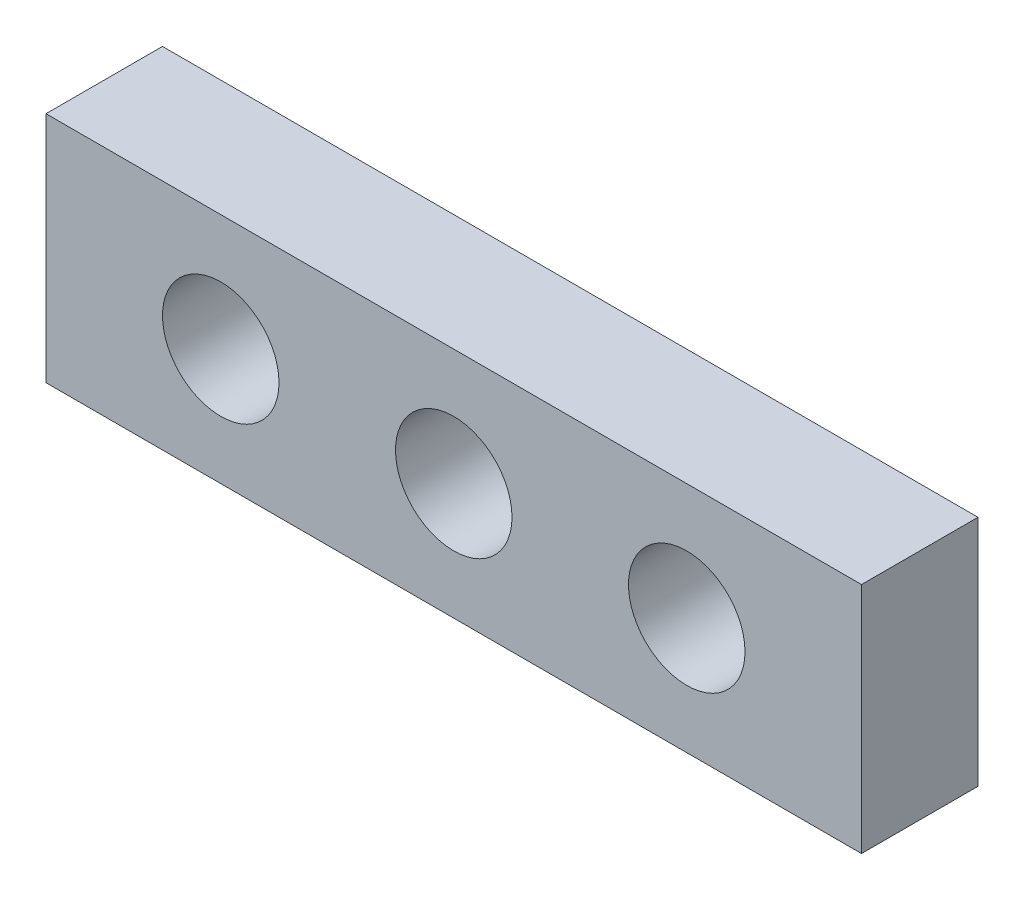
ISO-10303-21;
HEADER;
FILE_DESCRIPTION(('STEP AP214'),'2;1');
FILE_NAME('part.step','',(''),(''),'','','');
FILE_SCHEMA(('AUTOMOTIVE_DESIGN { 1 0 10303 214 1 1 1 1 }'));
ENDSEC;
DATA;
#1=APPLICATION_CONTEXT('core data for automotive mechanical design processes');
#2=APPLICATION_PROTOCOL_DEFINITION('international standard','automotive_design',2000,#1);
#3=PRODUCT_CONTEXT('',#1,'mechanical');
#4=PRODUCT('Part','Part','',(#3));
#5=PRODUCT_RELATED_PRODUCT_CATEGORY('part','',(#4));
#6=PRODUCT_DEFINITION_FORMATION('','',#4);
#7=PRODUCT_DEFINITION_CONTEXT('part definition',#1,'design');
#8=PRODUCT_DEFINITION('design','',#6,#7);
#9=PRODUCT_DEFINITION_SHAPE('','',#8);
#10=(LENGTH_UNIT() NAMED_UNIT(*) SI_UNIT(.MILLI.,.METRE.));
#11=(NAMED_UNIT(*) PLANE_ANGLE_UNIT() SI_UNIT($,.RADIAN.));
#12=(NAMED_UNIT(*) SI_UNIT($,.STERADIAN.) SOLID_ANGLE_UNIT());
#13=UNCERTAINTY_MEASURE_WITH_UNIT(LENGTH_MEASURE(1.E-05),#10,'distance_accuracy_value','');
#14=(GEOMETRIC_REPRESENTATION_CONTEXT(3) GLOBAL_UNCERTAINTY_ASSIGNED_CONTEXT((#13)) GLOBAL_UNIT_ASSIGNED_CONTEXT((#10,
#11,#12)) REPRESENTATION_CONTEXT('',''));
#15=CARTESIAN_POINT('',(0.,0.,0.));
#16=DIRECTION('',(0.,0.,1.));
#17=DIRECTION('',(1.,0.,0.));
#18=AXIS2_PLACEMENT_3D('',#15,#16,#17);
#19=CARTESIAN_POINT('',(0.,0.,-20.));
#20=DIRECTION('',(-1.,0.,0.));
#21=DIRECTION('',(0.,0.,1.));
#22=AXIS2_PLACEMENT_3D('',#19,#20,#21);
#23=PLANE('',#22);
#24=DIRECTION('',(0.,-1.,0.));
#25=VECTOR('',#24,1.);
#26=CARTESIAN_POINT('',(0.,0.,0.));
#27=LINE('',#26,#25);
#28=CARTESIAN_POINT('',(0.,40.,0.));
#29=VERTEX_POINT('',#28);
#30=CARTESIAN_POINT('',(0.,0.,0.));
#31=VERTEX_POINT('',#30);
#32=EDGE_CURVE('E110',#29,#31,#27,.T.);
#33=ORIENTED_EDGE('',*,*,#32,.F.);
#34=DIRECTION('',(0.,0.,1.));
#35=VECTOR('',#34,1.);
#36=CARTESIAN_POINT('',(0.,40.,-20.));
#37=LINE('',#36,#35);
#38=CARTESIAN_POINT('',(0.,40.,-20.));
#39=VERTEX_POINT('',#38);
#40=EDGE_CURVE('E11',#39,#29,#37,.T.);
#41=ORIENTED_EDGE('',*,*,#40,.F.);
#42=DIRECTION('',(0.,-1.,0.));
#43=VECTOR('',#42,1.);
#44=CARTESIAN_POINT('',(0.,0.,-20.));
#45=LINE('',#44,#43);
#46=CARTESIAN_POINT('',(0.,0.,-20.));
#47=VERTEX_POINT('',#46);
#48=EDGE_CURVE('E101',#39,#47,#45,.T.);
#49=ORIENTED_EDGE('',*,*,#48,.T.);
#50=DIRECTION('',(0.,0.,1.));
#51=VECTOR('',#50,1.);
#52=CARTESIAN_POINT('',(0.,0.,-20.));
#53=LINE('',#52,#51);
#54=EDGE_CURVE('E42',#47,#31,#53,.T.);
#55=ORIENTED_EDGE('',*,*,#54,.T.);
#56=EDGE_LOOP('',(#33,#41,#49,#55));
#57=FACE_BOUND('',#56,.T.);
#58=ADVANCED_FACE('F39',(#57),#23,.T.);
#59=CARTESIAN_POINT('',(0.,40.,-20.));
#60=DIRECTION('',(0.,1.,0.));
#61=DIRECTION('',(0.,0.,1.));
#62=AXIS2_PLACEMENT_3D('',#59,#60,#61);
#63=PLANE('',#62);
#64=DIRECTION('',(-1.,0.,0.));
#65=VECTOR('',#64,1.);
#66=CARTESIAN_POINT('',(0.,40.,0.));
#67=LINE('',#66,#65);
#68=CARTESIAN_POINT('',(140.,40.,0.));
#69=VERTEX_POINT('',#68);
#70=EDGE_CURVE('E104',#69,#29,#67,.T.);
#71=ORIENTED_EDGE('',*,*,#70,.F.);
#72=DIRECTION('',(0.,0.,1.));
#73=VECTOR('',#72,1.);
#74=CARTESIAN_POINT('',(140.,40.,-20.));
#75=LINE('',#74,#73);
#76=CARTESIAN_POINT('',(140.,40.,-20.));
#77=VERTEX_POINT('',#76);
#78=EDGE_CURVE('E49',#77,#69,#75,.T.);
#79=ORIENTED_EDGE('',*,*,#78,.F.);
#80=DIRECTION('',(-1.,0.,0.));
#81=VECTOR('',#80,1.);
#82=CARTESIAN_POINT('',(0.,40.,-20.));
#83=LINE('',#82,#81);
#84=EDGE_CURVE('E96',#77,#39,#83,.T.);
#85=ORIENTED_EDGE('',*,*,#84,.T.);
#86=ORIENTED_EDGE('',*,*,#40,.T.);
#87=EDGE_LOOP('',(#71,#79,#85,#86));
#88=FACE_BOUND('',#87,.T.);
#89=ADVANCED_FACE('F127',(#88),#63,.T.);
#90=CARTESIAN_POINT('',(140.,0.,-20.));
#91=DIRECTION('',(1.,0.,0.));
#92=DIRECTION('',(0.,0.,-1.));
#93=AXIS2_PLACEMENT_3D('',#90,#91,#92);
#94=PLANE('',#93);
#95=DIRECTION('',(0.,1.,0.));
#96=VECTOR('',#95,1.);
#97=CARTESIAN_POINT('',(140.,0.,0.));
#98=LINE('',#97,#96);
#99=CARTESIAN_POINT('',(140.,0.,0.));
#100=VERTEX_POINT('',#99);
#101=EDGE_CURVE('E90',#100,#69,#98,.T.);
#102=ORIENTED_EDGE('',*,*,#101,.F.);
#103=DIRECTION('',(0.,0.,1.));
#104=VECTOR('',#103,1.);
#105=CARTESIAN_POINT('',(140.,0.,-20.));
#106=LINE('',#105,#104);
#107=CARTESIAN_POINT('',(140.,0.,-20.));
#108=VERTEX_POINT('',#107);
#109=EDGE_CURVE('E85',#108,#100,#106,.T.);
#110=ORIENTED_EDGE('',*,*,#109,.F.);
#111=DIRECTION('',(0.,1.,0.));
#112=VECTOR('',#111,1.);
#113=CARTESIAN_POINT('',(140.,0.,-20.));
#114=LINE('',#113,#112);
#115=EDGE_CURVE('E88',#108,#77,#114,.T.);
#116=ORIENTED_EDGE('',*,*,#115,.T.);
#117=ORIENTED_EDGE('',*,*,#78,.T.);
#118=EDGE_LOOP('',(#102,#110,#116,#117));
#119=FACE_BOUND('',#118,.T.);
#120=ADVANCED_FACE('F87',(#119),#94,.T.);
#121=CARTESIAN_POINT('',(0.,0.,-20.));
#122=DIRECTION('',(0.,-1.,0.));
#123=DIRECTION('',(0.,0.,-1.));
#124=AXIS2_PLACEMENT_3D('',#121,#122,#123);
#125=PLANE('',#124);
#126=DIRECTION('',(1.,0.,0.));
#127=VECTOR('',#126,1.);
#128=CARTESIAN_POINT('',(0.,0.,0.));
#129=LINE('',#128,#127);
#130=EDGE_CURVE('E114',#31,#100,#129,.T.);
#131=ORIENTED_EDGE('',*,*,#130,.F.);
#132=ORIENTED_EDGE('',*,*,#54,.F.);
#133=DIRECTION('',(1.,0.,0.));
#134=VECTOR('',#133,1.);
#135=CARTESIAN_POINT('',(0.,0.,-20.));
#136=LINE('',#135,#134);
#137=EDGE_CURVE('E95',#47,#108,#136,.T.);
#138=ORIENTED_EDGE('',*,*,#137,.T.);
#139=ORIENTED_EDGE('',*,*,#109,.T.);
#140=EDGE_LOOP('',(#131,#132,#138,#139));
#141=FACE_BOUND('',#140,.T.);
#142=ADVANCED_FACE('F99',(#141),#125,.T.);
#143=CARTESIAN_POINT('',(0.,0.,-20.));
#144=DIRECTION('',(0.,0.,-1.));
#145=DIRECTION('',(-1.,0.,0.));
#146=AXIS2_PLACEMENT_3D('',#143,#144,#145);
#147=PLANE('',#146);
#148=CARTESIAN_POINT('',(110.,20.,-20.));
#149=DIRECTION('',(0.,0.,1.));
#150=DIRECTION('',(1.,0.,0.));
#151=AXIS2_PLACEMENT_3D('',#148,#149,#150);
#152=CIRCLE('',#151,9.99999999999999);
#153=CARTESIAN_POINT('',(120.,20.,-20.));
#154=VERTEX_POINT('',#153);
#155=EDGE_CURVE('E164',#154,#154,#152,.T.);
#156=ORIENTED_EDGE('',*,*,#155,.T.);
#157=EDGE_LOOP('',(#156));
#158=FACE_BOUND('',#157,.T.);
#159=CARTESIAN_POINT('',(70.,20.,-20.));
#160=DIRECTION('',(0.,0.,1.));
#161=DIRECTION('',(1.,0.,0.));
#162=AXIS2_PLACEMENT_3D('',#159,#160,#161);
#163=CIRCLE('',#162,9.99999999999999);
#164=CARTESIAN_POINT('',(80.,20.,-20.));
#165=VERTEX_POINT('',#164);
#166=EDGE_CURVE('E174',#165,#165,#163,.T.);
#167=ORIENTED_EDGE('',*,*,#166,.T.);
#168=EDGE_LOOP('',(#167));
#169=FACE_BOUND('',#168,.T.);
#170=CARTESIAN_POINT('',(30.,20.,-20.));
#171=DIRECTION('',(0.,0.,1.));
#172=DIRECTION('',(1.,0.,0.));
#173=AXIS2_PLACEMENT_3D('',#170,#171,#172);
#174=CIRCLE('',#173,10.);
#175=CARTESIAN_POINT('',(40.,20.,-20.));
#176=VERTEX_POINT('',#175);
#177=EDGE_CURVE('E115',#176,#176,#174,.T.);
#178=ORIENTED_EDGE('',*,*,#177,.T.);
#179=EDGE_LOOP('',(#178));
#180=FACE_BOUND('',#179,.T.);
#181=ORIENTED_EDGE('',*,*,#48,.F.);
#182=ORIENTED_EDGE('',*,*,#84,.F.);
#183=ORIENTED_EDGE('',*,*,#115,.F.);
#184=ORIENTED_EDGE('',*,*,#137,.F.);
#185=EDGE_LOOP('',(#181,#182,#183,#184));
#186=FACE_BOUND('',#185,.T.);
#187=ADVANCED_FACE('F94',(#158,#169,#180,#186),#147,.T.);
#188=CARTESIAN_POINT('',(0.,0.,0.));
#189=DIRECTION('',(0.,0.,-1.));
#190=DIRECTION('',(-1.,0.,0.));
#191=AXIS2_PLACEMENT_3D('',#188,#189,#190);
#192=PLANE('',#191);
#193=CARTESIAN_POINT('',(110.,20.,0.));
#194=DIRECTION('',(0.,0.,1.));
#195=DIRECTION('',(1.,0.,0.));
#196=AXIS2_PLACEMENT_3D('',#193,#194,#195);
#197=CIRCLE('',#196,9.99999999999999);
#198=CARTESIAN_POINT('',(120.,20.,0.));
#199=VERTEX_POINT('',#198);
#200=EDGE_CURVE('E167',#199,#199,#197,.T.);
#201=ORIENTED_EDGE('',*,*,#200,.F.);
#202=EDGE_LOOP('',(#201));
#203=FACE_BOUND('',#202,.T.);
#204=CARTESIAN_POINT('',(70.,20.,0.));
#205=DIRECTION('',(0.,0.,1.));
#206=DIRECTION('',(1.,0.,0.));
#207=AXIS2_PLACEMENT_3D('',#204,#205,#206);
#208=CIRCLE('',#207,9.99999999999999);
#209=CARTESIAN_POINT('',(80.,20.,0.));
#210=VERTEX_POINT('',#209);
#211=EDGE_CURVE('E171',#210,#210,#208,.T.);
#212=ORIENTED_EDGE('',*,*,#211,.F.);
#213=EDGE_LOOP('',(#212));
#214=FACE_BOUND('',#213,.T.);
#215=CARTESIAN_POINT('',(30.,20.,0.));
#216=DIRECTION('',(0.,0.,1.));
#217=DIRECTION('',(1.,0.,0.));
#218=AXIS2_PLACEMENT_3D('',#215,#216,#217);
#219=CIRCLE('',#218,10.);
#220=CARTESIAN_POINT('',(40.,20.,0.));
#221=VERTEX_POINT('',#220);
#222=EDGE_CURVE('E178',#221,#221,#219,.T.);
#223=ORIENTED_EDGE('',*,*,#222,.F.);
#224=EDGE_LOOP('',(#223));
#225=FACE_BOUND('',#224,.T.);
#226=ORIENTED_EDGE('',*,*,#32,.T.);
#227=ORIENTED_EDGE('',*,*,#130,.T.);
#228=ORIENTED_EDGE('',*,*,#101,.T.);
#229=ORIENTED_EDGE('',*,*,#70,.T.);
#230=EDGE_LOOP('',(#226,#227,#228,#229));
#231=FACE_BOUND('',#230,.T.);
#232=ADVANCED_FACE('F126',(#203,#214,#225,#231),#192,.F.);
#233=CARTESIAN_POINT('',(30.,20.,-20.));
#234=DIRECTION('',(0.,0.,1.));
#235=DIRECTION('',(1.,0.,0.));
#236=AXIS2_PLACEMENT_3D('',#233,#234,#235);
#237=CYLINDRICAL_SURFACE('',#236,10.);
#238=ORIENTED_EDGE('',*,*,#177,.F.);
#239=EDGE_LOOP('',(#238));
#240=FACE_BOUND('',#239,.T.);
#241=ORIENTED_EDGE('',*,*,#222,.T.);
#242=EDGE_LOOP('',(#241));
#243=FACE_BOUND('',#242,.T.);
#244=ADVANCED_FACE('F145',(#240,#243),#237,.F.);
#245=CARTESIAN_POINT('',(70.,20.,-20.));
#246=DIRECTION('',(0.,0.,1.));
#247=DIRECTION('',(1.,0.,0.));
#248=AXIS2_PLACEMENT_3D('',#245,#246,#247);
#249=CYLINDRICAL_SURFACE('',#248,9.99999999999999);
#250=ORIENTED_EDGE('',*,*,#166,.F.);
#251=EDGE_LOOP('',(#250));
#252=FACE_BOUND('',#251,.T.);
#253=ORIENTED_EDGE('',*,*,#211,.T.);
#254=EDGE_LOOP('',(#253));
#255=FACE_BOUND('',#254,.T.);
#256=ADVANCED_FACE('F152',(#252,#255),#249,.F.);
#257=CARTESIAN_POINT('',(110.,20.,-20.));
#258=DIRECTION('',(0.,0.,1.));
#259=DIRECTION('',(1.,0.,0.));
#260=AXIS2_PLACEMENT_3D('',#257,#258,#259);
#261=CYLINDRICAL_SURFACE('',#260,9.99999999999999);
#262=ORIENTED_EDGE('',*,*,#155,.F.);
#263=EDGE_LOOP('',(#262));
#264=FACE_BOUND('',#263,.T.);
#265=ORIENTED_EDGE('',*,*,#200,.T.);
#266=EDGE_LOOP('',(#265));
#267=FACE_BOUND('',#266,.T.);
#268=ADVANCED_FACE('F156',(#264,#267),#261,.F.);
#269=CLOSED_SHELL('',(#58,#89,#120,#142,#187,#232,#244,#256,#268));
#270=MANIFOLD_SOLID_BREP('B2',#269);
#271=ADVANCED_BREP_SHAPE_REPRESENTATION('',(#18,#270),#14);
#272=SHAPE_DEFINITION_REPRESENTATION(#9,#271);
ENDSEC;
END-ISO-10303-21;
